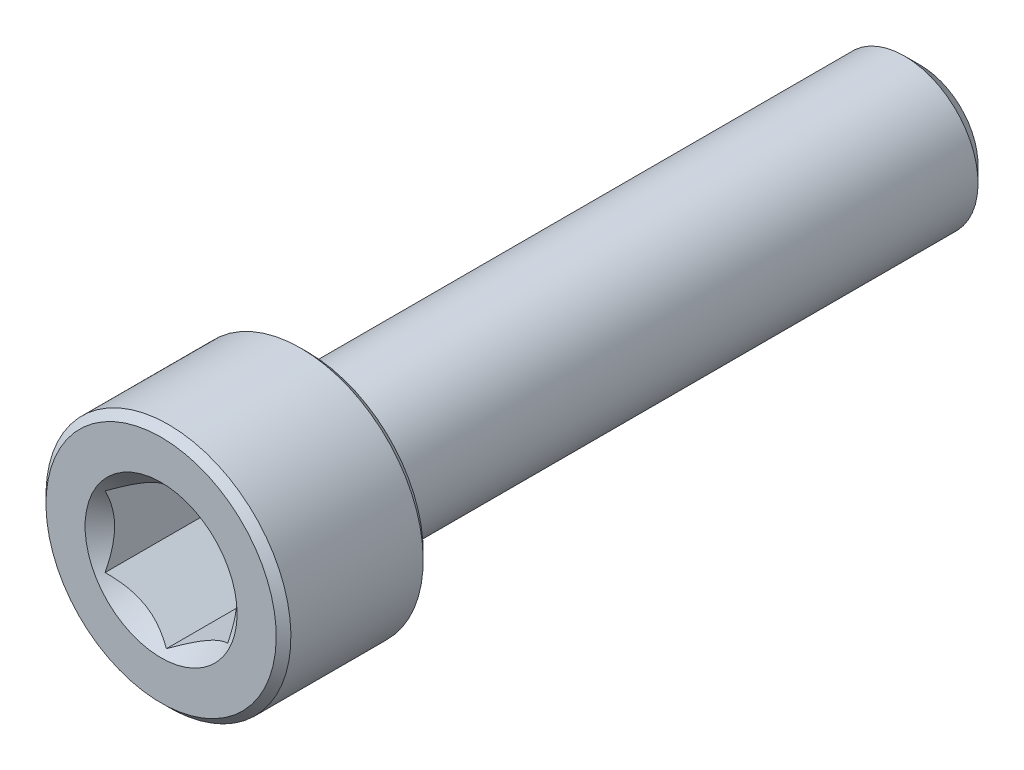
ISO-10303-21;
HEADER;
FILE_DESCRIPTION(('STEP AP214'),'2;1');
FILE_NAME('part.step','',(''),(''),'','','');
FILE_SCHEMA(('AUTOMOTIVE_DESIGN { 1 0 10303 214 1 1 1 1 }'));
ENDSEC;
DATA;
#1=APPLICATION_CONTEXT('core data for automotive mechanical design processes');
#2=APPLICATION_PROTOCOL_DEFINITION('international standard','automotive_design',2000,#1);
#3=PRODUCT_CONTEXT('',#1,'mechanical');
#4=PRODUCT('Part','Part','',(#3));
#5=PRODUCT_RELATED_PRODUCT_CATEGORY('part','',(#4));
#6=PRODUCT_DEFINITION_FORMATION('','',#4);
#7=PRODUCT_DEFINITION_CONTEXT('part definition',#1,'design');
#8=PRODUCT_DEFINITION('design','',#6,#7);
#9=PRODUCT_DEFINITION_SHAPE('','',#8);
#10=(LENGTH_UNIT() NAMED_UNIT(*) SI_UNIT(.MILLI.,.METRE.));
#11=(NAMED_UNIT(*) PLANE_ANGLE_UNIT() SI_UNIT($,.RADIAN.));
#12=(NAMED_UNIT(*) SI_UNIT($,.STERADIAN.) SOLID_ANGLE_UNIT());
#13=UNCERTAINTY_MEASURE_WITH_UNIT(LENGTH_MEASURE(1.E-05),#10,'distance_accuracy_value','');
#14=(GEOMETRIC_REPRESENTATION_CONTEXT(3) GLOBAL_UNCERTAINTY_ASSIGNED_CONTEXT((#13)) GLOBAL_UNIT_ASSIGNED_CONTEXT((#10,
#11,#12)) REPRESENTATION_CONTEXT('',''));
#15=CARTESIAN_POINT('',(0.,0.,0.));
#16=DIRECTION('',(0.,0.,1.));
#17=DIRECTION('',(1.,0.,0.));
#18=AXIS2_PLACEMENT_3D('',#15,#16,#17);
#19=CARTESIAN_POINT('',(0.,2.35048094716167,-15.5));
#20=DIRECTION('',(0.,0.,-1.));
#21=DIRECTION('',(0.,1.,0.));
#22=AXIS2_PLACEMENT_3D('',#19,#20,#21);
#23=PLANE('',#22);
#24=CARTESIAN_POINT('',(0.,0.,-15.5));
#25=DIRECTION('',(0.,0.,-1.));
#26=DIRECTION('',(0.,1.,0.));
#27=AXIS2_PLACEMENT_3D('',#24,#25,#26);
#28=CIRCLE('',#27,2.35048094716167);
#29=CARTESIAN_POINT('',(0.,2.35048094716167,-15.5));
#30=VERTEX_POINT('',#29);
#31=EDGE_CURVE('E57',#30,#30,#28,.T.);
#32=ORIENTED_EDGE('',*,*,#31,.T.);
#33=EDGE_LOOP('',(#32));
#34=FACE_BOUND('',#33,.T.);
#35=ADVANCED_FACE('F43',(#34),#23,.T.);
#36=CARTESIAN_POINT('',(0.,0.,-15.5));
#37=DIRECTION('',(0.,0.,1.));
#38=DIRECTION('',(0.,-1.,0.));
#39=AXIS2_PLACEMENT_3D('',#36,#37,#38);
#40=CONICAL_SURFACE('',#39,2.35048094716167,0.785398163397445);
#41=CARTESIAN_POINT('',(0.,0.,-14.8504809471617));
#42=DIRECTION('',(0.,0.,-1.));
#43=DIRECTION('',(0.,1.,0.));
#44=AXIS2_PLACEMENT_3D('',#41,#42,#43);
#45=CIRCLE('',#44,3.);
#46=CARTESIAN_POINT('',(0.,3.,-14.8504809471617));
#47=VERTEX_POINT('',#46);
#48=EDGE_CURVE('E175',#47,#47,#45,.T.);
#49=ORIENTED_EDGE('',*,*,#48,.T.);
#50=EDGE_LOOP('',(#49));
#51=FACE_BOUND('',#50,.T.);
#52=ORIENTED_EDGE('',*,*,#31,.F.);
#53=EDGE_LOOP('',(#52));
#54=FACE_BOUND('',#53,.T.);
#55=ADVANCED_FACE('F183',(#51,#54),#40,.T.);
#56=CARTESIAN_POINT('',(0.,0.,-15.5));
#57=DIRECTION('',(0.,0.,-1.));
#58=DIRECTION('',(0.,1.,0.));
#59=AXIS2_PLACEMENT_3D('',#56,#57,#58);
#60=CYLINDRICAL_SURFACE('',#59,3.);
#61=CARTESIAN_POINT('',(0.,0.,9.2));
#62=DIRECTION('',(0.,0.,-1.));
#63=DIRECTION('',(0.,1.,0.));
#64=AXIS2_PLACEMENT_3D('',#61,#62,#63);
#65=CIRCLE('',#64,3.);
#66=CARTESIAN_POINT('',(0.,3.,9.2));
#67=VERTEX_POINT('',#66);
#68=EDGE_CURVE('E171',#67,#67,#65,.T.);
#69=ORIENTED_EDGE('',*,*,#68,.T.);
#70=EDGE_LOOP('',(#69));
#71=FACE_BOUND('',#70,.T.);
#72=ORIENTED_EDGE('',*,*,#48,.F.);
#73=EDGE_LOOP('',(#72));
#74=FACE_BOUND('',#73,.T.);
#75=ADVANCED_FACE('F185',(#71,#74),#60,.T.);
#76=CARTESIAN_POINT('',(0.,0.,9.2));
#77=DIRECTION('',(0.,0.,-1.));
#78=DIRECTION('',(0.,1.,0.));
#79=AXIS2_PLACEMENT_3D('',#76,#77,#78);
#80=TOROIDAL_SURFACE('',#79,3.3,0.3);
#81=CARTESIAN_POINT('',(0.,0.,9.5));
#82=DIRECTION('',(0.,0.,-1.));
#83=DIRECTION('',(0.,1.,0.));
#84=AXIS2_PLACEMENT_3D('',#81,#82,#83);
#85=CIRCLE('',#84,3.3);
#86=CARTESIAN_POINT('',(0.,3.3,9.5));
#87=VERTEX_POINT('',#86);
#88=EDGE_CURVE('E167',#87,#87,#85,.T.);
#89=ORIENTED_EDGE('',*,*,#88,.T.);
#90=EDGE_LOOP('',(#89));
#91=FACE_BOUND('',#90,.T.);
#92=ORIENTED_EDGE('',*,*,#68,.F.);
#93=EDGE_LOOP('',(#92));
#94=FACE_BOUND('',#93,.T.);
#95=ADVANCED_FACE('F191',(#91,#94),#80,.F.);
#96=CARTESIAN_POINT('',(0.,4.7,9.5));
#97=DIRECTION('',(0.,0.,-1.));
#98=DIRECTION('',(0.,1.,0.));
#99=AXIS2_PLACEMENT_3D('',#96,#97,#98);
#100=PLANE('',#99);
#101=CARTESIAN_POINT('',(0.,0.,9.5));
#102=DIRECTION('',(0.,0.,-1.));
#103=DIRECTION('',(0.,1.,0.));
#104=AXIS2_PLACEMENT_3D('',#101,#102,#103);
#105=CIRCLE('',#104,4.7);
#106=CARTESIAN_POINT('',(0.,4.7,9.5));
#107=VERTEX_POINT('',#106);
#108=EDGE_CURVE('E163',#107,#107,#105,.T.);
#109=ORIENTED_EDGE('',*,*,#108,.T.);
#110=EDGE_LOOP('',(#109));
#111=FACE_BOUND('',#110,.T.);
#112=ORIENTED_EDGE('',*,*,#88,.F.);
#113=EDGE_LOOP('',(#112));
#114=FACE_BOUND('',#113,.T.);
#115=ADVANCED_FACE('F197',(#111,#114),#100,.T.);
#116=CARTESIAN_POINT('',(0.,0.,9.5));
#117=DIRECTION('',(0.,0.,1.));
#118=DIRECTION('',(0.,-1.,0.));
#119=AXIS2_PLACEMENT_3D('',#116,#117,#118);
#120=CONICAL_SURFACE('',#119,4.7,0.785398163397445);
#121=CARTESIAN_POINT('',(0.,0.,9.8));
#122=DIRECTION('',(0.,0.,-1.));
#123=DIRECTION('',(0.,1.,0.));
#124=AXIS2_PLACEMENT_3D('',#121,#122,#123);
#125=CIRCLE('',#124,5.);
#126=CARTESIAN_POINT('',(0.,5.,9.8));
#127=VERTEX_POINT('',#126);
#128=EDGE_CURVE('E159',#127,#127,#125,.T.);
#129=ORIENTED_EDGE('',*,*,#128,.T.);
#130=EDGE_LOOP('',(#129));
#131=FACE_BOUND('',#130,.T.);
#132=ORIENTED_EDGE('',*,*,#108,.F.);
#133=EDGE_LOOP('',(#132));
#134=FACE_BOUND('',#133,.T.);
#135=ADVANCED_FACE('F201',(#131,#134),#120,.T.);
#136=CARTESIAN_POINT('',(0.,0.,-15.5));
#137=DIRECTION('',(0.,0.,-1.));
#138=DIRECTION('',(0.,1.,0.));
#139=AXIS2_PLACEMENT_3D('',#136,#137,#138);
#140=CYLINDRICAL_SURFACE('',#139,5.);
#141=CARTESIAN_POINT('',(0.,0.,15.2));
#142=DIRECTION('',(0.,0.,-1.));
#143=DIRECTION('',(0.,1.,0.));
#144=AXIS2_PLACEMENT_3D('',#141,#142,#143);
#145=CIRCLE('',#144,5.);
#146=CARTESIAN_POINT('',(0.,5.,15.2));
#147=VERTEX_POINT('',#146);
#148=EDGE_CURVE('E155',#147,#147,#145,.T.);
#149=ORIENTED_EDGE('',*,*,#148,.T.);
#150=EDGE_LOOP('',(#149));
#151=FACE_BOUND('',#150,.T.);
#152=ORIENTED_EDGE('',*,*,#128,.F.);
#153=EDGE_LOOP('',(#152));
#154=FACE_BOUND('',#153,.T.);
#155=ADVANCED_FACE('F205',(#151,#154),#140,.T.);
#156=CARTESIAN_POINT('',(0.,0.,15.2));
#157=DIRECTION('',(0.,0.,-1.));
#158=DIRECTION('',(0.,1.,0.));
#159=AXIS2_PLACEMENT_3D('',#156,#157,#158);
#160=CONICAL_SURFACE('',#159,5.,0.785398163397451);
#161=CARTESIAN_POINT('',(0.,0.,15.5));
#162=DIRECTION('',(0.,0.,-1.));
#163=DIRECTION('',(0.,1.,0.));
#164=AXIS2_PLACEMENT_3D('',#161,#162,#163);
#165=CIRCLE('',#164,4.7);
#166=CARTESIAN_POINT('',(0.,4.7,15.5));
#167=VERTEX_POINT('',#166);
#168=EDGE_CURVE('E151',#167,#167,#165,.T.);
#169=ORIENTED_EDGE('',*,*,#168,.T.);
#170=EDGE_LOOP('',(#169));
#171=FACE_BOUND('',#170,.T.);
#172=ORIENTED_EDGE('',*,*,#148,.F.);
#173=EDGE_LOOP('',(#172));
#174=FACE_BOUND('',#173,.T.);
#175=ADVANCED_FACE('F209',(#171,#174),#160,.T.);
#176=CARTESIAN_POINT('',(0.,0.,15.5));
#177=DIRECTION('',(0.,0.,1.));
#178=DIRECTION('',(0.,-1.,0.));
#179=AXIS2_PLACEMENT_3D('',#176,#177,#178);
#180=PLANE('',#179);
#181=CARTESIAN_POINT('',(0.,0.,15.5));
#182=DIRECTION('',(0.,0.,1.));
#183=DIRECTION('',(1.,0.,0.));
#184=AXIS2_PLACEMENT_3D('',#181,#182,#183);
#185=CIRCLE('',#184,3.10325769689424);
#186=CARTESIAN_POINT('',(3.10325769689424,0.,15.5));
#187=VERTEX_POINT('',#186);
#188=EDGE_CURVE('E117',#187,#187,#185,.T.);
#189=ORIENTED_EDGE('',*,*,#188,.F.);
#190=EDGE_LOOP('',(#189));
#191=FACE_BOUND('',#190,.T.);
#192=ORIENTED_EDGE('',*,*,#168,.F.);
#193=EDGE_LOOP('',(#192));
#194=FACE_BOUND('',#193,.T.);
#195=ADVANCED_FACE('F213',(#191,#194),#180,.T.);
#196=CARTESIAN_POINT('',(0.,0.,15.5));
#197=DIRECTION('',(0.,0.,1.));
#198=DIRECTION('',(1.,0.,0.));
#199=AXIS2_PLACEMENT_3D('',#196,#197,#198);
#200=CONICAL_SURFACE('',#199,3.10325769689424,0.78539816339745);
#201=ORIENTED_EDGE('',*,*,#188,.T.);
#202=EDGE_LOOP('',(#201));
#203=FACE_BOUND('',#202,.T.);
#204=CARTESIAN_POINT('',(-0.000199999999999129,-2.88686681600197,15.2836091260357));
#205=CARTESIAN_POINT('',(0.0857382777877656,-2.83725032818751,15.2340343544086));
#206=CARTESIAN_POINT('',(0.173113567275754,-2.7868041812811,15.1873711304164));
#207=CARTESIAN_POINT('',(0.35128145616559,-2.6839389026696,15.1019317890922));
#208=CARTESIAN_POINT('',(0.442091000681076,-2.6315099876986,15.0632032114599));
#209=CARTESIAN_POINT('',(0.625204123126923,-2.52578957716234,14.9968603529516));
#210=CARTESIAN_POINT('',(0.717461064529343,-2.47252500720904,14.9690793175847));
#211=CARTESIAN_POINT('',(0.904006008776288,-2.3648232334321,14.9262768249646));
#212=CARTESIAN_POINT('',(0.998288312566285,-2.31038931995913,14.9112234157252));
#213=CARTESIAN_POINT('',(1.16077825829185,-2.21657570605387,14.8976413712634));
#214=CARTESIAN_POINT('',(1.22877596788015,-2.17731721011878,14.8956307482947));
#215=CARTESIAN_POINT('',(1.36466024116922,-2.0988643883567,14.8990177662414));
#216=CARTESIAN_POINT('',(1.43254675755224,-2.05967008984862,14.9044180043537));
#217=CARTESIAN_POINT('',(1.56767878823611,-1.98165157555715,14.9223194374564));
#218=CARTESIAN_POINT('',(1.63492349975356,-1.94282782326096,14.9348285761004));
#219=CARTESIAN_POINT('',(1.7682501008182,-1.86585167424616,14.9662611510096));
#220=CARTESIAN_POINT('',(1.83433207909966,-1.82769922629678,14.9851840955507));
#221=CARTESIAN_POINT('',(2.00359634669127,-1.72997445583858,15.0413610104621));
#222=CARTESIAN_POINT('',(2.10572912222289,-1.67100807039231,15.0828494806501));
#223=CARTESIAN_POINT('',(2.25590641494051,-1.58430317001562,15.152887695777));
#224=CARTESIAN_POINT('',(2.30539653988261,-1.55573003305807,15.17749590117));
#225=CARTESIAN_POINT('',(2.40346006383885,-1.49911303110426,15.2289555357691));
#226=CARTESIAN_POINT('',(2.45203400349693,-1.47106885396706,15.2558055878332));
#227=CARTESIAN_POINT('',(2.5002,-1.44326020292023,15.2836091260357));
#228=B_SPLINE_CURVE_WITH_KNOTS('',3,(#204,#205,#206,#207,#208,#209,#210,#211,#212,#213,#214,
#215,#216,#217,#218,#219,#220,#221,#222,#223,#224,#225,#226,#227),.UNSPECIFIED.,.F.,.F.,(4,2,2,
2,2,2,2,2,2,2,2,4),(0.,0.333012085133925,0.667964518301398,0.997597032043301,1.32639954393844,
1.56169424147169,1.79707142102083,2.03271213522171,2.26833478775651,2.64260240809533,
2.82922877818864,3.01574133749025),.UNSPECIFIED.);
#229=CARTESIAN_POINT('',(0.,-2.88675134594813,15.2834936490539));
#230=VERTEX_POINT('',#229);
#231=CARTESIAN_POINT('',(2.5,-1.44337567297406,15.2834936490539));
#232=VERTEX_POINT('',#231);
#233=EDGE_CURVE('E12',#230,#232,#228,.T.);
#234=ORIENTED_EDGE('',*,*,#233,.F.);
#235=CARTESIAN_POINT('',(-2.5002,-1.44326020292023,15.2836091260357));
#236=CARTESIAN_POINT('',(-2.41426172221224,-1.49287669073469,15.2340343544086));
#237=CARTESIAN_POINT('',(-2.32688643272425,-1.5433228376411,15.1873711304164));
#238=CARTESIAN_POINT('',(-2.14871854383441,-1.64618811625259,15.1019317890922));
#239=CARTESIAN_POINT('',(-2.05790899931893,-1.69861703122359,15.0632032114599));
#240=CARTESIAN_POINT('',(-1.87479587687308,-1.80433744175986,14.9968603529516));
#241=CARTESIAN_POINT('',(-1.78253893547066,-1.85760201171315,14.9690793175848));
#242=CARTESIAN_POINT('',(-1.59599399122372,-1.96530378549009,14.9262768249646));
#243=CARTESIAN_POINT('',(-1.50171168743372,-2.01973769896307,14.9112234157252));
#244=CARTESIAN_POINT('',(-1.33922174170816,-2.11355131286833,14.8976413712634));
#245=CARTESIAN_POINT('',(-1.27122403211985,-2.15280980880341,14.8956307482947));
#246=CARTESIAN_POINT('',(-1.13533975883078,-2.23126263056549,14.8990177662414));
#247=CARTESIAN_POINT('',(-1.06745324244776,-2.27045692907358,14.9044180043537));
#248=CARTESIAN_POINT('',(-0.932321211763895,-2.34847544336505,14.9223194374564));
#249=CARTESIAN_POINT('',(-0.865076500246441,-2.38729919566123,14.9348285761004));
#250=CARTESIAN_POINT('',(-0.731749899181802,-2.46427534467604,14.9662611510096));
#251=CARTESIAN_POINT('',(-0.665667920900344,-2.50242779262542,14.9851840955507));
#252=CARTESIAN_POINT('',(-0.496403653308736,-2.60015256308362,15.0413610104621));
#253=CARTESIAN_POINT('',(-0.394270877777107,-2.65911894852989,15.0828494806501));
#254=CARTESIAN_POINT('',(-0.244093585059491,-2.74582384890657,15.152887695777));
#255=CARTESIAN_POINT('',(-0.194603460117391,-2.77439698586412,15.17749590117));
#256=CARTESIAN_POINT('',(-0.0965399361611526,-2.83101398781794,15.2289555357691));
#257=CARTESIAN_POINT('',(-0.0479659965030713,-2.85905816495513,15.2558055878332));
#258=CARTESIAN_POINT('',(0.000200000000000756,-2.88686681600197,15.2836091260357));
#259=B_SPLINE_CURVE_WITH_KNOTS('',3,(#235,#236,#237,#238,#239,#240,#241,#242,#243,#244,#245,
#246,#247,#248,#249,#250,#251,#252,#253,#254,#255,#256,#257,#258),.UNSPECIFIED.,.F.,.F.,(4,2,2,
2,2,2,2,2,2,2,2,4),(0.,0.333012085133923,0.667964518301396,0.997597032043298,1.32639954393844,
1.56169424147169,1.79707142102083,2.03271213522171,2.26833478775651,2.64260240809533,
2.82922877818864,3.01574133749025),.UNSPECIFIED.);
#260=CARTESIAN_POINT('',(-2.5,-1.44337567297407,15.2834936490539));
#261=VERTEX_POINT('',#260);
#262=EDGE_CURVE('E102',#261,#230,#259,.T.);
#263=ORIENTED_EDGE('',*,*,#262,.F.);
#264=CARTESIAN_POINT('',(-2.5,-3.0404429247869,16.3330214063817));
#265=CARTESIAN_POINT('',(-2.5,-2.96709478172557,16.2763788487171));
#266=CARTESIAN_POINT('',(-2.5,-2.89335465135762,16.2202359693275));
#267=CARTESIAN_POINT('',(-2.5,-2.74492905640712,16.1091787819783));
#268=CARTESIAN_POINT('',(-2.5,-2.67024337493575,16.0542647641906));
#269=CARTESIAN_POINT('',(-2.5,-2.51921990828824,15.9455038420407));
#270=CARTESIAN_POINT('',(-2.5,-2.44287382770905,15.891668419147));
#271=CARTESIAN_POINT('',(-2.5,-2.28891665120372,15.7858441602624));
#272=CARTESIAN_POINT('',(-2.5,-2.21130564250585,15.7338551977207));
#273=CARTESIAN_POINT('',(-2.5,-2.04951799142745,15.6288457042913));
#274=CARTESIAN_POINT('',(-2.5,-1.96524215656549,15.5759772332794));
#275=CARTESIAN_POINT('',(-2.5,-1.79473490703969,15.4734987026906));
#276=CARTESIAN_POINT('',(-2.5,-1.70850374831487,15.4238882199388));
#277=CARTESIAN_POINT('',(-2.5,-1.53401833929875,15.3289545270337));
#278=CARTESIAN_POINT('',(-2.5,-1.44577065756376,15.2836193384592));
#279=CARTESIAN_POINT('',(-2.5,-1.26676310994809,15.1982604224777));
#280=CARTESIAN_POINT('',(-2.5,-1.17600446376454,15.158234169168));
#281=CARTESIAN_POINT('',(-2.5,-1.00118351570532,15.0886962875671));
#282=CARTESIAN_POINT('',(-2.5,-0.917385051629538,15.0585280842829));
#283=CARTESIAN_POINT('',(-2.5,-0.747629060099933,15.0048969377877));
#284=CARTESIAN_POINT('',(-2.5,-0.661671397551606,14.9814344152734));
#285=CARTESIAN_POINT('',(-2.5,-0.489622081200868,14.9428857605003));
#286=CARTESIAN_POINT('',(-2.5,-0.40356552129825,14.9276456482725));
#287=CARTESIAN_POINT('',(-2.5,-0.230352389629818,14.9058639492467));
#288=CARTESIAN_POINT('',(-2.5,-0.143196059113861,14.8993204870893));
#289=CARTESIAN_POINT('',(-2.5,0.0273612295446633,14.895504167584));
#290=CARTESIAN_POINT('',(-2.5,0.110753131974798,14.8978241071313));
#291=CARTESIAN_POINT('',(-2.5,0.276898134935754,14.9106653349727));
#292=CARTESIAN_POINT('',(-2.5,0.359651177707743,14.921187356241));
#293=CARTESIAN_POINT('',(-2.5,0.525325927795181,14.9500114990314));
#294=CARTESIAN_POINT('',(-2.5,0.608223175291064,14.9684520406654));
#295=CARTESIAN_POINT('',(-2.5,0.772178834557464,15.0120846864152));
#296=CARTESIAN_POINT('',(-2.5,0.853237339741925,15.0372764467107));
#297=CARTESIAN_POINT('',(-2.5,1.10159689599555,15.1241193926927));
#298=CARTESIAN_POINT('',(-2.5,1.2655525401235,15.1953668377804));
#299=CARTESIAN_POINT('',(-2.5,1.50551769780196,15.3142345481021));
#300=CARTESIAN_POINT('',(-2.5,1.58465788064155,15.3559484521643));
#301=CARTESIAN_POINT('',(-2.5,1.74114816885994,15.4426161601922));
#302=CARTESIAN_POINT('',(-2.5,1.81849858456148,15.4875693968529));
#303=CARTESIAN_POINT('',(-2.5,1.96784059769267,15.5777853522682));
#304=CARTESIAN_POINT('',(-2.5,2.03990833441822,15.6229234485208));
#305=CARTESIAN_POINT('',(-2.5,2.18280709640722,15.7151257428437));
#306=CARTESIAN_POINT('',(-2.5,2.2536380285734,15.7621900850232));
#307=CARTESIAN_POINT('',(-2.5,2.39365462675841,15.8575181428367));
#308=CARTESIAN_POINT('',(-2.5,2.46284892785043,15.905769227967));
#309=CARTESIAN_POINT('',(-2.5,2.60028772768959,16.0035675953205));
#310=CARTESIAN_POINT('',(-2.5,2.66853248306038,16.0531145164816));
#311=CARTESIAN_POINT('',(-2.5,2.73637900498552,16.1031920948776));
#312=B_SPLINE_CURVE_WITH_KNOTS('',3,(#264,#265,#266,#267,#268,#269,#270,#271,#272,#273,#274,
#275,#276,#277,#278,#279,#280,#281,#282,#283,#284,#285,#286,#287,#288,#289,#290,#291,#292,#293,
#294,#295,#296,#297,#298,#299,#300,#301,#302,#303,#304,#305,#306,#307,#308,#309,#310,#311),
.UNSPECIFIED.,.F.,.F.,(4,2,2,2,2,2,2,2,2,2,2,2,2,2,2,2,2,2,2,2,2,2,2,4),(0.,0.278024739230088,
0.556114450273837,0.836346737531473,1.11655978131476,1.41496015304213,1.71332168905073,
2.01082076966666,2.30817779353377,2.57513879386764,2.84211653895115,3.10390388797607,
3.36563477559628,3.61548897009284,3.86536549522731,4.11980016461986,4.37422187884309,
4.90887010890445,5.17722912654037,5.44554126009378,5.70061957252692,5.95571700326383,
6.20877059828287,6.46175442014512),.UNSPECIFIED.);
#313=CARTESIAN_POINT('',(-2.5,1.44337567297406,15.2834936490539));
#314=VERTEX_POINT('',#313);
#315=EDGE_CURVE('E116',#314,#261,#312,.F.);
#316=ORIENTED_EDGE('',*,*,#315,.F.);
#317=CARTESIAN_POINT('',(0.000199999999999144,2.88686681600197,15.2836091260357));
#318=CARTESIAN_POINT('',(-0.0857382777877656,2.83725032818751,15.2340343544086));
#319=CARTESIAN_POINT('',(-0.173113567275754,2.7868041812811,15.1873711304164));
#320=CARTESIAN_POINT('',(-0.351281456165589,2.6839389026696,15.1019317890922));
#321=CARTESIAN_POINT('',(-0.442091000681075,2.6315099876986,15.0632032114599));
#322=CARTESIAN_POINT('',(-0.625204123126922,2.52578957716234,14.9968603529516));
#323=CARTESIAN_POINT('',(-0.717461064529341,2.47252500720904,14.9690793175847));
#324=CARTESIAN_POINT('',(-0.904006008776287,2.3648232334321,14.9262768249646));
#325=CARTESIAN_POINT('',(-0.998288312566284,2.31038931995913,14.9112234157252));
#326=CARTESIAN_POINT('',(-1.16077825829185,2.21657570605387,14.8976413712634));
#327=CARTESIAN_POINT('',(-1.22877596788015,2.17731721011878,14.8956307482947));
#328=CARTESIAN_POINT('',(-1.36466024116922,2.0988643883567,14.8990177662414));
#329=CARTESIAN_POINT('',(-1.43254675755224,2.05967008984862,14.9044180043537));
#330=CARTESIAN_POINT('',(-1.56767878823611,1.98165157555715,14.9223194374564));
#331=CARTESIAN_POINT('',(-1.63492349975356,1.94282782326096,14.9348285761004));
#332=CARTESIAN_POINT('',(-1.7682501008182,1.86585167424616,14.9662611510096));
#333=CARTESIAN_POINT('',(-1.83433207909966,1.82769922629677,14.9851840955507));
#334=CARTESIAN_POINT('',(-2.00359634669127,1.72997445583858,15.0413610104621));
#335=CARTESIAN_POINT('',(-2.10572912222289,1.67100807039231,15.0828494806501));
#336=CARTESIAN_POINT('',(-2.25590641494051,1.58430317001562,15.152887695777));
#337=CARTESIAN_POINT('',(-2.30539653988261,1.55573003305807,15.17749590117));
#338=CARTESIAN_POINT('',(-2.40346006383885,1.49911303110425,15.2289555357691));
#339=CARTESIAN_POINT('',(-2.45203400349693,1.47106885396706,15.2558055878332));
#340=CARTESIAN_POINT('',(-2.5002,1.44326020292023,15.2836091260357));
#341=B_SPLINE_CURVE_WITH_KNOTS('',3,(#317,#318,#319,#320,#321,#322,#323,#324,#325,#326,#327,
#328,#329,#330,#331,#332,#333,#334,#335,#336,#337,#338,#339,#340),.UNSPECIFIED.,.F.,.F.,(4,2,2,
2,2,2,2,2,2,2,2,4),(0.,0.333012085133924,0.667964518301397,0.997597032043299,1.32639954393844,
1.56169424147169,1.79707142102083,2.03271213522171,2.26833478775651,2.64260240809533,
2.82922877818864,3.01574133749025),.UNSPECIFIED.);
#342=CARTESIAN_POINT('',(0.,2.88675134594813,15.2834936490539));
#343=VERTEX_POINT('',#342);
#344=EDGE_CURVE('E264',#343,#314,#341,.T.);
#345=ORIENTED_EDGE('',*,*,#344,.F.);
#346=CARTESIAN_POINT('',(2.5002,1.44326020292023,15.2836091260357));
#347=CARTESIAN_POINT('',(2.41426172221224,1.49287669073469,15.2340343544086));
#348=CARTESIAN_POINT('',(2.32688643272425,1.5433228376411,15.1873711304164));
#349=CARTESIAN_POINT('',(2.14871854383441,1.64618811625259,15.1019317890922));
#350=CARTESIAN_POINT('',(2.05790899931893,1.69861703122359,15.0632032114599));
#351=CARTESIAN_POINT('',(1.87479587687308,1.80433744175986,14.9968603529516));
#352=CARTESIAN_POINT('',(1.78253893547066,1.85760201171315,14.9690793175847));
#353=CARTESIAN_POINT('',(1.59599399122371,1.96530378549009,14.9262768249646));
#354=CARTESIAN_POINT('',(1.50171168743372,2.01973769896306,14.9112234157252));
#355=CARTESIAN_POINT('',(1.33922174170815,2.11355131286833,14.8976413712634));
#356=CARTESIAN_POINT('',(1.27122403211985,2.15280980880341,14.8956307482947));
#357=CARTESIAN_POINT('',(1.13533975883078,2.23126263056549,14.8990177662414));
#358=CARTESIAN_POINT('',(1.06745324244776,2.27045692907357,14.9044180043537));
#359=CARTESIAN_POINT('',(0.932321211763894,2.34847544336505,14.9223194374564));
#360=CARTESIAN_POINT('',(0.86507650024644,2.38729919566123,14.9348285761004));
#361=CARTESIAN_POINT('',(0.731749899181801,2.46427534467603,14.9662611510096));
#362=CARTESIAN_POINT('',(0.665667920900343,2.50242779262542,14.9851840955507));
#363=CARTESIAN_POINT('',(0.496403653308736,2.60015256308362,15.0413610104621));
#364=CARTESIAN_POINT('',(0.394270877777108,2.65911894852989,15.0828494806501));
#365=CARTESIAN_POINT('',(0.244093585059491,2.74582384890657,15.152887695777));
#366=CARTESIAN_POINT('',(0.19460346011739,2.77439698586412,15.17749590117));
#367=CARTESIAN_POINT('',(0.0965399361611525,2.83101398781794,15.2289555357691));
#368=CARTESIAN_POINT('',(0.0479659965030713,2.85905816495513,15.2558055878332));
#369=CARTESIAN_POINT('',(-0.00020000000000088,2.88686681600197,15.2836091260357));
#370=B_SPLINE_CURVE_WITH_KNOTS('',3,(#346,#347,#348,#349,#350,#351,#352,#353,#354,#355,#356,
#357,#358,#359,#360,#361,#362,#363,#364,#365,#366,#367,#368,#369),.UNSPECIFIED.,.F.,.F.,(4,2,2,
2,2,2,2,2,2,2,2,4),(0.,0.333012085133925,0.667964518301397,0.997597032043299,1.32639954393844,
1.56169424147169,1.79707142102083,2.03271213522171,2.26833478775651,2.64260240809533,
2.82922877818864,3.01574133749025),.UNSPECIFIED.);
#371=CARTESIAN_POINT('',(2.5,1.44337567297406,15.2834936490539));
#372=VERTEX_POINT('',#371);
#373=EDGE_CURVE('E237',#372,#343,#370,.T.);
#374=ORIENTED_EDGE('',*,*,#373,.F.);
#375=CARTESIAN_POINT('',(2.5,-3.0404429247869,16.3330214063817));
#376=CARTESIAN_POINT('',(2.5,-2.96709478172557,16.2763788487171));
#377=CARTESIAN_POINT('',(2.5,-2.89335465135762,16.2202359693275));
#378=CARTESIAN_POINT('',(2.5,-2.74492905640712,16.1091787819783));
#379=CARTESIAN_POINT('',(2.5,-2.67024337493575,16.0542647641906));
#380=CARTESIAN_POINT('',(2.5,-2.51921990828824,15.9455038420407));
#381=CARTESIAN_POINT('',(2.5,-2.44287382770905,15.891668419147));
#382=CARTESIAN_POINT('',(2.5,-2.28891665120372,15.7858441602624));
#383=CARTESIAN_POINT('',(2.5,-2.21130564250585,15.7338551977207));
#384=CARTESIAN_POINT('',(2.5,-2.04951799142744,15.6288457042913));
#385=CARTESIAN_POINT('',(2.5,-1.96524215656549,15.5759772332794));
#386=CARTESIAN_POINT('',(2.5,-1.79473490703968,15.4734987026906));
#387=CARTESIAN_POINT('',(2.5,-1.70850374831487,15.4238882199388));
#388=CARTESIAN_POINT('',(2.5,-1.53401833929875,15.3289545270337));
#389=CARTESIAN_POINT('',(2.5,-1.44577065756376,15.2836193384592));
#390=CARTESIAN_POINT('',(2.5,-1.26676310994809,15.1982604224777));
#391=CARTESIAN_POINT('',(2.5,-1.17600446376454,15.158234169168));
#392=CARTESIAN_POINT('',(2.5,-1.00118351570532,15.0886962875671));
#393=CARTESIAN_POINT('',(2.5,-0.917385051629537,15.0585280842829));
#394=CARTESIAN_POINT('',(2.5,-0.747629060099932,15.0048969377877));
#395=CARTESIAN_POINT('',(2.5,-0.661671397551605,14.9814344152734));
#396=CARTESIAN_POINT('',(2.5,-0.489622081200868,14.9428857605003));
#397=CARTESIAN_POINT('',(2.5,-0.40356552129825,14.9276456482725));
#398=CARTESIAN_POINT('',(2.5,-0.230352389629818,14.9058639492467));
#399=CARTESIAN_POINT('',(2.5,-0.143196059113861,14.8993204870893));
#400=CARTESIAN_POINT('',(2.5,0.0273612295446629,14.895504167584));
#401=CARTESIAN_POINT('',(2.5,0.110753131974797,14.8978241071313));
#402=CARTESIAN_POINT('',(2.5,0.276898134935754,14.9106653349727));
#403=CARTESIAN_POINT('',(2.5,0.359651177707742,14.921187356241));
#404=CARTESIAN_POINT('',(2.5,0.52532592779518,14.9500114990314));
#405=CARTESIAN_POINT('',(2.5,0.608223175291063,14.9684520406654));
#406=CARTESIAN_POINT('',(2.5,0.772178834557464,15.0120846864152));
#407=CARTESIAN_POINT('',(2.5,0.853237339741924,15.0372764467107));
#408=CARTESIAN_POINT('',(2.5,1.10159689599554,15.1241193926927));
#409=CARTESIAN_POINT('',(2.5,1.2655525401235,15.1953668377804));
#410=CARTESIAN_POINT('',(2.5,1.50551769780196,15.3142345481021));
#411=CARTESIAN_POINT('',(2.5,1.58465788064155,15.3559484521643));
#412=CARTESIAN_POINT('',(2.5,1.74114816885993,15.4426161601922));
#413=CARTESIAN_POINT('',(2.5,1.81849858456147,15.4875693968529));
#414=CARTESIAN_POINT('',(2.5,1.96784059769267,15.5777853522682));
#415=CARTESIAN_POINT('',(2.5,2.03990833441822,15.6229234485208));
#416=CARTESIAN_POINT('',(2.5,2.18280709640722,15.7151257428437));
#417=CARTESIAN_POINT('',(2.5,2.2536380285734,15.7621900850232));
#418=CARTESIAN_POINT('',(2.5,2.39365462675841,15.8575181428367));
#419=CARTESIAN_POINT('',(2.5,2.46284892785042,15.905769227967));
#420=CARTESIAN_POINT('',(2.5,2.60028772768959,16.0035675953205));
#421=CARTESIAN_POINT('',(2.5,2.66853248306037,16.0531145164816));
#422=CARTESIAN_POINT('',(2.5,2.73637900498552,16.1031920948776));
#423=B_SPLINE_CURVE_WITH_KNOTS('',3,(#375,#376,#377,#378,#379,#380,#381,#382,#383,#384,#385,
#386,#387,#388,#389,#390,#391,#392,#393,#394,#395,#396,#397,#398,#399,#400,#401,#402,#403,#404,
#405,#406,#407,#408,#409,#410,#411,#412,#413,#414,#415,#416,#417,#418,#419,#420,#421,#422),
.UNSPECIFIED.,.F.,.F.,(4,2,2,2,2,2,2,2,2,2,2,2,2,2,2,2,2,2,2,2,2,2,2,4),(0.,0.278024739230089,
0.556114450273837,0.836346737531476,1.11655978131476,1.41496015304214,1.71332168905073,
2.01082076966666,2.30817779353377,2.57513879386764,2.84211653895115,3.10390388797607,
3.36563477559628,3.61548897009284,3.86536549522731,4.11980016461986,4.37422187884309,
4.90887010890445,5.17722912654036,5.44554126009378,5.70061957252692,5.95571700326383,
6.20877059828287,6.46175442014512),.UNSPECIFIED.);
#424=EDGE_CURVE('E64',#232,#372,#423,.T.);
#425=ORIENTED_EDGE('',*,*,#424,.F.);
#426=EDGE_LOOP('',(#234,#263,#316,#345,#374,#425));
#427=FACE_BOUND('',#426,.T.);
#428=ADVANCED_FACE('F101',(#203,#427),#200,.F.);
#429=CARTESIAN_POINT('',(0.,4.7,10.5));
#430=DIRECTION('',(0.,0.,-1.));
#431=DIRECTION('',(0.,1.,0.));
#432=AXIS2_PLACEMENT_3D('',#429,#430,#431);
#433=PLANE('',#432);
#434=DIRECTION('',(0.866025403784438,0.5,0.));
#435=VECTOR('',#434,1.);
#436=CARTESIAN_POINT('',(0.,-2.88675134594813,10.5));
#437=LINE('',#436,#435);
#438=CARTESIAN_POINT('',(0.,-2.88675134594813,10.5));
#439=VERTEX_POINT('',#438);
#440=CARTESIAN_POINT('',(2.5,-1.44337567297406,10.5));
#441=VERTEX_POINT('',#440);
#442=EDGE_CURVE('E120',#439,#441,#437,.T.);
#443=ORIENTED_EDGE('',*,*,#442,.T.);
#444=DIRECTION('',(0.,1.,0.));
#445=VECTOR('',#444,1.);
#446=CARTESIAN_POINT('',(2.5,-1.44337567297406,10.5));
#447=LINE('',#446,#445);
#448=CARTESIAN_POINT('',(2.5,1.44337567297406,10.5));
#449=VERTEX_POINT('',#448);
#450=EDGE_CURVE('E71',#441,#449,#447,.T.);
#451=ORIENTED_EDGE('',*,*,#450,.T.);
#452=DIRECTION('',(-0.866025403784439,0.5,0.));
#453=VECTOR('',#452,1.);
#454=CARTESIAN_POINT('',(2.5,1.44337567297406,10.5));
#455=LINE('',#454,#453);
#456=CARTESIAN_POINT('',(0.,2.88675134594813,10.5));
#457=VERTEX_POINT('',#456);
#458=EDGE_CURVE('E131',#449,#457,#455,.T.);
#459=ORIENTED_EDGE('',*,*,#458,.T.);
#460=DIRECTION('',(-0.866025403784439,-0.5,0.));
#461=VECTOR('',#460,1.);
#462=CARTESIAN_POINT('',(0.,2.88675134594813,10.5));
#463=LINE('',#462,#461);
#464=CARTESIAN_POINT('',(-2.5,1.44337567297406,10.5));
#465=VERTEX_POINT('',#464);
#466=EDGE_CURVE('E140',#457,#465,#463,.T.);
#467=ORIENTED_EDGE('',*,*,#466,.T.);
#468=DIRECTION('',(0.,-1.,0.));
#469=VECTOR('',#468,1.);
#470=CARTESIAN_POINT('',(-2.5,1.44337567297406,10.5));
#471=LINE('',#470,#469);
#472=CARTESIAN_POINT('',(-2.5,-1.44337567297406,10.5));
#473=VERTEX_POINT('',#472);
#474=EDGE_CURVE('E135',#465,#473,#471,.T.);
#475=ORIENTED_EDGE('',*,*,#474,.T.);
#476=DIRECTION('',(0.866025403784439,-0.5,0.));
#477=VECTOR('',#476,1.);
#478=CARTESIAN_POINT('',(-2.5,-1.44337567297407,10.5));
#479=LINE('',#478,#477);
#480=EDGE_CURVE('E122',#473,#439,#479,.T.);
#481=ORIENTED_EDGE('',*,*,#480,.T.);
#482=EDGE_LOOP('',(#443,#451,#459,#467,#475,#481));
#483=FACE_BOUND('',#482,.T.);
#484=ADVANCED_FACE('F218',(#483),#433,.F.);
#485=CARTESIAN_POINT('',(0.,-2.88675134594813,1.86237384174027));
#486=DIRECTION('',(0.5,-0.866025403784438,0.));
#487=DIRECTION('',(0.866025403784438,0.5,0.));
#488=AXIS2_PLACEMENT_3D('',#485,#486,#487);
#489=PLANE('',#488);
#490=DIRECTION('',(0.,0.,1.));
#491=VECTOR('',#490,1.);
#492=CARTESIAN_POINT('',(0.,-2.88675134594813,1.86237384174027));
#493=LINE('',#492,#491);
#494=EDGE_CURVE('E111',#439,#230,#493,.T.);
#495=ORIENTED_EDGE('',*,*,#494,.T.);
#496=ORIENTED_EDGE('',*,*,#233,.T.);
#497=DIRECTION('',(0.,0.,1.));
#498=VECTOR('',#497,1.);
#499=CARTESIAN_POINT('',(2.5,-1.44337567297406,1.86237384174027));
#500=LINE('',#499,#498);
#501=EDGE_CURVE('E126',#441,#232,#500,.T.);
#502=ORIENTED_EDGE('',*,*,#501,.F.);
#503=ORIENTED_EDGE('',*,*,#442,.F.);
#504=EDGE_LOOP('',(#495,#496,#502,#503));
#505=FACE_BOUND('',#504,.T.);
#506=ADVANCED_FACE('F119',(#505),#489,.F.);
#507=CARTESIAN_POINT('',(-2.5,-1.44337567297407,1.86237384174027));
#508=DIRECTION('',(-0.5,-0.866025403784439,0.));
#509=DIRECTION('',(0.866025403784439,-0.5,0.));
#510=AXIS2_PLACEMENT_3D('',#507,#508,#509);
#511=PLANE('',#510);
#512=DIRECTION('',(0.,0.,1.));
#513=VECTOR('',#512,1.);
#514=CARTESIAN_POINT('',(-2.5,-1.44337567297407,1.86237384174027));
#515=LINE('',#514,#513);
#516=EDGE_CURVE('E114',#473,#261,#515,.T.);
#517=ORIENTED_EDGE('',*,*,#516,.T.);
#518=ORIENTED_EDGE('',*,*,#262,.T.);
#519=ORIENTED_EDGE('',*,*,#494,.F.);
#520=ORIENTED_EDGE('',*,*,#480,.F.);
#521=EDGE_LOOP('',(#517,#518,#519,#520));
#522=FACE_BOUND('',#521,.T.);
#523=ADVANCED_FACE('F110',(#522),#511,.F.);
#524=CARTESIAN_POINT('',(-2.5,1.44337567297406,1.86237384174027));
#525=DIRECTION('',(-1.,0.,0.));
#526=DIRECTION('',(0.,0.,1.));
#527=AXIS2_PLACEMENT_3D('',#524,#525,#526);
#528=PLANE('',#527);
#529=DIRECTION('',(0.,0.,1.));
#530=VECTOR('',#529,1.);
#531=CARTESIAN_POINT('',(-2.5,1.44337567297406,1.86237384174027));
#532=LINE('',#531,#530);
#533=EDGE_CURVE('E136',#465,#314,#532,.T.);
#534=ORIENTED_EDGE('',*,*,#533,.T.);
#535=ORIENTED_EDGE('',*,*,#315,.T.);
#536=ORIENTED_EDGE('',*,*,#516,.F.);
#537=ORIENTED_EDGE('',*,*,#474,.F.);
#538=EDGE_LOOP('',(#534,#535,#536,#537));
#539=FACE_BOUND('',#538,.T.);
#540=ADVANCED_FACE('F274',(#539),#528,.F.);
#541=CARTESIAN_POINT('',(0.,2.88675134594813,1.86237384174027));
#542=DIRECTION('',(-0.5,0.866025403784438,0.));
#543=DIRECTION('',(-0.866025403784439,-0.5,0.));
#544=AXIS2_PLACEMENT_3D('',#541,#542,#543);
#545=PLANE('',#544);
#546=DIRECTION('',(0.,0.,1.));
#547=VECTOR('',#546,1.);
#548=CARTESIAN_POINT('',(0.,2.88675134594813,1.86237384174027));
#549=LINE('',#548,#547);
#550=EDGE_CURVE('E141',#457,#343,#549,.T.);
#551=ORIENTED_EDGE('',*,*,#550,.T.);
#552=ORIENTED_EDGE('',*,*,#344,.T.);
#553=ORIENTED_EDGE('',*,*,#533,.F.);
#554=ORIENTED_EDGE('',*,*,#466,.F.);
#555=EDGE_LOOP('',(#551,#552,#553,#554));
#556=FACE_BOUND('',#555,.T.);
#557=ADVANCED_FACE('F271',(#556),#545,.F.);
#558=CARTESIAN_POINT('',(2.5,1.44337567297406,1.86237384174027));
#559=DIRECTION('',(0.5,0.866025403784439,0.));
#560=DIRECTION('',(-0.866025403784439,0.5,0.));
#561=AXIS2_PLACEMENT_3D('',#558,#559,#560);
#562=PLANE('',#561);
#563=DIRECTION('',(0.,0.,1.));
#564=VECTOR('',#563,1.);
#565=CARTESIAN_POINT('',(2.5,1.44337567297406,1.86237384174027));
#566=LINE('',#565,#564);
#567=EDGE_CURVE('E145',#449,#372,#566,.T.);
#568=ORIENTED_EDGE('',*,*,#567,.T.);
#569=ORIENTED_EDGE('',*,*,#373,.T.);
#570=ORIENTED_EDGE('',*,*,#550,.F.);
#571=ORIENTED_EDGE('',*,*,#458,.F.);
#572=EDGE_LOOP('',(#568,#569,#570,#571));
#573=FACE_BOUND('',#572,.T.);
#574=ADVANCED_FACE('F226',(#573),#562,.F.);
#575=CARTESIAN_POINT('',(2.5,-1.44337567297406,1.86237384174027));
#576=DIRECTION('',(1.,0.,0.));
#577=DIRECTION('',(0.,0.,-1.));
#578=AXIS2_PLACEMENT_3D('',#575,#576,#577);
#579=PLANE('',#578);
#580=ORIENTED_EDGE('',*,*,#501,.T.);
#581=ORIENTED_EDGE('',*,*,#424,.T.);
#582=ORIENTED_EDGE('',*,*,#567,.F.);
#583=ORIENTED_EDGE('',*,*,#450,.F.);
#584=EDGE_LOOP('',(#580,#581,#582,#583));
#585=FACE_BOUND('',#584,.T.);
#586=ADVANCED_FACE('F222',(#585),#579,.F.);
#587=CLOSED_SHELL('',(#35,#55,#75,#95,#115,#135,#155,#175,#195,#428,#484,#506,#523,#540,#557,
#574,#586));
#588=MANIFOLD_SOLID_BREP('B2',#587);
#589=ADVANCED_BREP_SHAPE_REPRESENTATION('',(#18,#588),#14);
#590=SHAPE_DEFINITION_REPRESENTATION(#9,#589);
ENDSEC;
END-ISO-10303-21;
